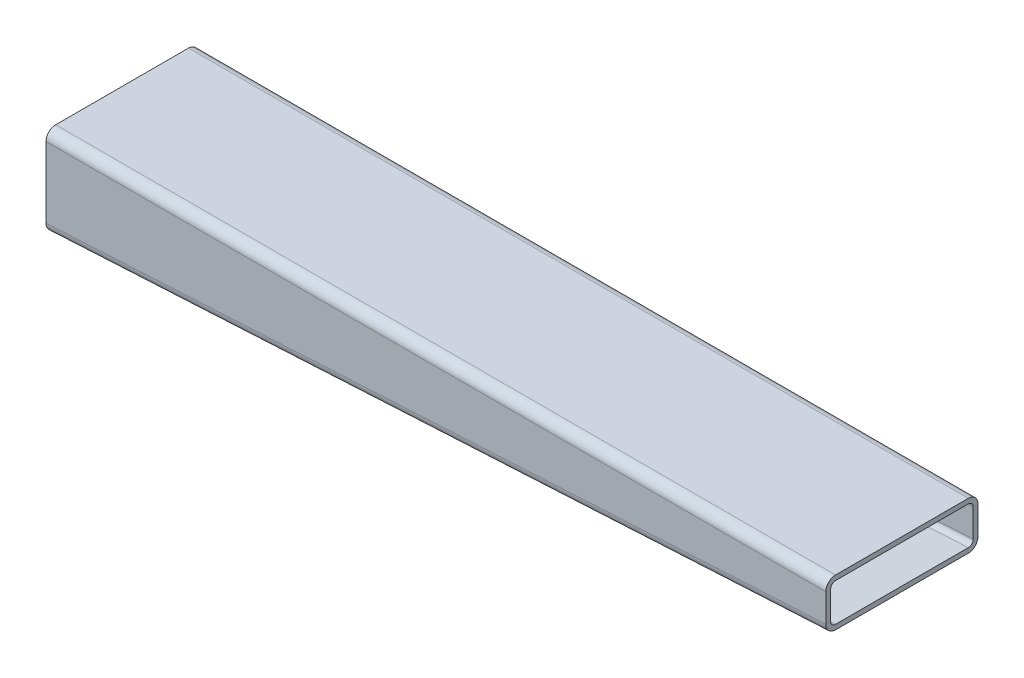
ISO-10303-21;
HEADER;
FILE_DESCRIPTION(('STEP AP214'),'2;1');
FILE_NAME('part.step','',(''),(''),'','','');
FILE_SCHEMA(('AUTOMOTIVE_DESIGN { 1 0 10303 214 1 1 1 1 }'));
ENDSEC;
DATA;
#1=APPLICATION_CONTEXT('core data for automotive mechanical design processes');
#2=APPLICATION_PROTOCOL_DEFINITION('international standard','automotive_design',2000,#1);
#3=PRODUCT_CONTEXT('',#1,'mechanical');
#4=PRODUCT('Part','Part','',(#3));
#5=PRODUCT_RELATED_PRODUCT_CATEGORY('part','',(#4));
#6=PRODUCT_DEFINITION_FORMATION('','',#4);
#7=PRODUCT_DEFINITION_CONTEXT('part definition',#1,'design');
#8=PRODUCT_DEFINITION('design','',#6,#7);
#9=PRODUCT_DEFINITION_SHAPE('','',#8);
#10=(LENGTH_UNIT() NAMED_UNIT(*) SI_UNIT(.MILLI.,.METRE.));
#11=(NAMED_UNIT(*) PLANE_ANGLE_UNIT() SI_UNIT($,.RADIAN.));
#12=(NAMED_UNIT(*) SI_UNIT($,.STERADIAN.) SOLID_ANGLE_UNIT());
#13=UNCERTAINTY_MEASURE_WITH_UNIT(LENGTH_MEASURE(1.E-05),#10,'distance_accuracy_value','');
#14=(GEOMETRIC_REPRESENTATION_CONTEXT(3) GLOBAL_UNCERTAINTY_ASSIGNED_CONTEXT((#13)) GLOBAL_UNIT_ASSIGNED_CONTEXT((#10,
#11,#12)) REPRESENTATION_CONTEXT('',''));
#15=CARTESIAN_POINT('',(0.,0.,0.));
#16=DIRECTION('',(0.,0.,1.));
#17=DIRECTION('',(1.,0.,0.));
#18=AXIS2_PLACEMENT_3D('',#15,#16,#17);
#19=CARTESIAN_POINT('',(-1.37334345273566,22.8332010753825,3.11187354387963));
#20=DIRECTION('',(0.998513539846474,0.0545042268385142,0.));
#21=DIRECTION('',(-0.0545042268385142,0.998513539846474,0.));
#22=AXIS2_PLACEMENT_3D('',#19,#20,#21);
#23=CYLINDRICAL_SURFACE('',#22,5.08);
#24=DIRECTION('',(-0.998513539846474,-0.0545042268385142,0.));
#25=VECTOR('',#24,1.);
#26=CARTESIAN_POINT('',(-1.37334345273566,22.8332010753825,-1.96812645612037));
#27=LINE('',#26,#25);
#28=CARTESIAN_POINT('',(406.324966402938,45.0875624588737,-1.96812645612037));
#29=VERTEX_POINT('',#28);
#30=CARTESIAN_POINT('',(-3.67503359706234,22.7075624768737,-1.96812645612037));
#31=VERTEX_POINT('',#30);
#32=EDGE_CURVE('E266',#29,#31,#27,.T.);
#33=ORIENTED_EDGE('',*,*,#32,.F.);
#34=CARTESIAN_POINT('',(406.324966402938,45.0875624588737,3.11187354387963));
#35=DIRECTION('',(-1.,0.,0.));
#36=DIRECTION('',(0.,1.,0.));
#37=AXIS2_PLACEMENT_3D('',#34,#35,#36);
#38=ELLIPSE('',#37,5.08756245887369,5.08);
#39=CARTESIAN_POINT('',(406.324966402938,40.,3.11187354387963));
#40=VERTEX_POINT('',#39);
#41=EDGE_CURVE('E40',#40,#29,#38,.F.);
#42=ORIENTED_EDGE('',*,*,#41,.F.);
#43=DIRECTION('',(-0.998513539846474,-0.0545042268385142,0.));
#44=VECTOR('',#43,1.);
#45=CARTESIAN_POINT('',(-1.09646198039601,17.7607522929624,3.11187354387963));
#46=LINE('',#45,#44);
#47=CARTESIAN_POINT('',(-3.67503359706233,17.620000018,3.11187354387963));
#48=VERTEX_POINT('',#47);
#49=EDGE_CURVE('E269',#48,#40,#46,.F.);
#50=ORIENTED_EDGE('',*,*,#49,.F.);
#51=CARTESIAN_POINT('',(-3.67503359706234,22.7075624768737,3.11187354387963));
#52=DIRECTION('',(1.,0.,0.));
#53=DIRECTION('',(0.,1.,0.));
#54=AXIS2_PLACEMENT_3D('',#51,#52,#53);
#55=ELLIPSE('',#54,5.08756245887369,5.08);
#56=EDGE_CURVE('E11',#31,#48,#55,.F.);
#57=ORIENTED_EDGE('',*,*,#56,.F.);
#58=EDGE_LOOP('',(#33,#42,#50,#57));
#59=FACE_BOUND('',#58,.T.);
#60=ADVANCED_FACE('F33',(#59),#23,.T.);
#61=CARTESIAN_POINT('',(0.,59.92,3.11187354387963));
#62=DIRECTION('',(1.,0.,0.));
#63=DIRECTION('',(0.,0.,-1.));
#64=AXIS2_PLACEMENT_3D('',#61,#62,#63);
#65=CYLINDRICAL_SURFACE('',#64,5.08);
#66=DIRECTION('',(-1.,0.,0.));
#67=VECTOR('',#66,1.);
#68=CARTESIAN_POINT('',(0.,65.,3.11187354387963));
#69=LINE('',#68,#67);
#70=CARTESIAN_POINT('',(406.324966402938,65.,3.11187354387963));
#71=VERTEX_POINT('',#70);
#72=CARTESIAN_POINT('',(-3.67503359706234,65.,3.11187354387963));
#73=VERTEX_POINT('',#72);
#74=EDGE_CURVE('E256',#71,#73,#69,.T.);
#75=ORIENTED_EDGE('',*,*,#74,.F.);
#76=CARTESIAN_POINT('',(406.324966402938,59.92,3.11187354387963));
#77=DIRECTION('',(-1.,0.,0.));
#78=DIRECTION('',(0.,0.,1.));
#79=AXIS2_PLACEMENT_3D('',#76,#77,#78);
#80=CIRCLE('',#79,5.08);
#81=CARTESIAN_POINT('',(406.324966402938,59.92,-1.96812645612037));
#82=VERTEX_POINT('',#81);
#83=EDGE_CURVE('E262',#82,#71,#80,.F.);
#84=ORIENTED_EDGE('',*,*,#83,.F.);
#85=DIRECTION('',(-1.,0.,0.));
#86=VECTOR('',#85,1.);
#87=CARTESIAN_POINT('',(0.,59.92,-1.96812645612037));
#88=LINE('',#87,#86);
#89=CARTESIAN_POINT('',(-3.67503359706234,59.92,-1.96812645612037));
#90=VERTEX_POINT('',#89);
#91=EDGE_CURVE('E259',#90,#82,#88,.F.);
#92=ORIENTED_EDGE('',*,*,#91,.F.);
#93=CARTESIAN_POINT('',(-3.67503359706234,59.92,3.11187354387963));
#94=DIRECTION('',(1.,0.,0.));
#95=DIRECTION('',(0.,0.,-1.));
#96=AXIS2_PLACEMENT_3D('',#93,#94,#95);
#97=CIRCLE('',#96,5.08);
#98=EDGE_CURVE('E264',#73,#90,#97,.F.);
#99=ORIENTED_EDGE('',*,*,#98,.F.);
#100=EDGE_LOOP('',(#75,#84,#92,#99));
#101=FACE_BOUND('',#100,.T.);
#102=ADVANCED_FACE('F283',(#101),#65,.T.);
#103=CARTESIAN_POINT('',(-1.37334345273565,22.8332010753825,72.9518735638796));
#104=DIRECTION('',(-0.998513539846474,-0.0545042268385142,0.));
#105=DIRECTION('',(0.0545042268385142,-0.998513539846474,0.));
#106=AXIS2_PLACEMENT_3D('',#103,#104,#105);
#107=CYLINDRICAL_SURFACE('',#106,5.08);
#108=DIRECTION('',(0.998513539846474,0.0545042268385142,0.));
#109=VECTOR('',#108,1.);
#110=CARTESIAN_POINT('',(-1.37334345273565,22.8332010753825,78.0318735638796));
#111=LINE('',#110,#109);
#112=CARTESIAN_POINT('',(-3.67503359706233,22.7075624768737,78.0318735638796));
#113=VERTEX_POINT('',#112);
#114=CARTESIAN_POINT('',(406.324966402938,45.0875624588737,78.0318735638796));
#115=VERTEX_POINT('',#114);
#116=EDGE_CURVE('E245',#113,#115,#111,.T.);
#117=ORIENTED_EDGE('',*,*,#116,.F.);
#118=CARTESIAN_POINT('',(-3.67503359706233,22.7075624768737,72.9518735638796));
#119=DIRECTION('',(1.,0.,0.));
#120=DIRECTION('',(0.,-1.,0.));
#121=AXIS2_PLACEMENT_3D('',#118,#119,#120);
#122=ELLIPSE('',#121,5.08756245887369,5.08);
#123=CARTESIAN_POINT('',(-3.67503359706233,17.620000018,72.9518735638796));
#124=VERTEX_POINT('',#123);
#125=EDGE_CURVE('E251',#124,#113,#122,.F.);
#126=ORIENTED_EDGE('',*,*,#125,.F.);
#127=DIRECTION('',(0.998513539846474,0.0545042268385142,0.));
#128=VECTOR('',#127,1.);
#129=CARTESIAN_POINT('',(-1.096461980396,17.7607522929624,72.9518735638796));
#130=LINE('',#129,#128);
#131=CARTESIAN_POINT('',(406.324966402938,40.,72.9518735638796));
#132=VERTEX_POINT('',#131);
#133=EDGE_CURVE('E248',#132,#124,#130,.F.);
#134=ORIENTED_EDGE('',*,*,#133,.F.);
#135=CARTESIAN_POINT('',(406.324966402938,45.0875624588737,72.9518735638796));
#136=DIRECTION('',(-1.,0.,0.));
#137=DIRECTION('',(0.,-1.,0.));
#138=AXIS2_PLACEMENT_3D('',#135,#136,#137);
#139=ELLIPSE('',#138,5.08756245887369,5.08);
#140=EDGE_CURVE('E253',#115,#132,#139,.F.);
#141=ORIENTED_EDGE('',*,*,#140,.F.);
#142=EDGE_LOOP('',(#117,#126,#134,#141));
#143=FACE_BOUND('',#142,.T.);
#144=ADVANCED_FACE('F300',(#143),#107,.T.);
#145=CARTESIAN_POINT('',(0.,59.92,72.9518735638796));
#146=DIRECTION('',(-1.,0.,0.));
#147=DIRECTION('',(0.,0.,1.));
#148=AXIS2_PLACEMENT_3D('',#145,#146,#147);
#149=CYLINDRICAL_SURFACE('',#148,5.08);
#150=DIRECTION('',(1.,0.,0.));
#151=VECTOR('',#150,1.);
#152=CARTESIAN_POINT('',(0.,65.,72.9518735638796));
#153=LINE('',#152,#151);
#154=CARTESIAN_POINT('',(-3.67503359706233,65.,72.9518735638796));
#155=VERTEX_POINT('',#154);
#156=CARTESIAN_POINT('',(406.324966402938,65.,72.9518735638796));
#157=VERTEX_POINT('',#156);
#158=EDGE_CURVE('E234',#155,#157,#153,.T.);
#159=ORIENTED_EDGE('',*,*,#158,.F.);
#160=CARTESIAN_POINT('',(-3.67503359706233,59.92,72.9518735638796));
#161=DIRECTION('',(1.,0.,0.));
#162=DIRECTION('',(0.,0.,-1.));
#163=AXIS2_PLACEMENT_3D('',#160,#161,#162);
#164=CIRCLE('',#163,5.08);
#165=CARTESIAN_POINT('',(-3.67503359706233,59.92,78.0318735638796));
#166=VERTEX_POINT('',#165);
#167=EDGE_CURVE('E240',#166,#155,#164,.F.);
#168=ORIENTED_EDGE('',*,*,#167,.F.);
#169=DIRECTION('',(1.,0.,0.));
#170=VECTOR('',#169,1.);
#171=CARTESIAN_POINT('',(0.,59.92,78.0318735638796));
#172=LINE('',#171,#170);
#173=CARTESIAN_POINT('',(406.324966402938,59.92,78.0318735638796));
#174=VERTEX_POINT('',#173);
#175=EDGE_CURVE('E237',#174,#166,#172,.F.);
#176=ORIENTED_EDGE('',*,*,#175,.F.);
#177=CARTESIAN_POINT('',(406.324966402938,59.92,72.9518735638796));
#178=DIRECTION('',(-1.,0.,0.));
#179=DIRECTION('',(0.,0.,1.));
#180=AXIS2_PLACEMENT_3D('',#177,#178,#179);
#181=CIRCLE('',#180,5.08);
#182=EDGE_CURVE('E243',#157,#174,#181,.F.);
#183=ORIENTED_EDGE('',*,*,#182,.F.);
#184=EDGE_LOOP('',(#159,#168,#176,#183));
#185=FACE_BOUND('',#184,.T.);
#186=ADVANCED_FACE('F291',(#185),#149,.T.);
#187=CARTESIAN_POINT('',(-3.67503359706234,65.,-1.96812645612037));
#188=DIRECTION('',(1.,0.,0.));
#189=DIRECTION('',(0.,0.,-1.));
#190=AXIS2_PLACEMENT_3D('',#187,#188,#189);
#191=PLANE('',#190);
#192=DIRECTION('',(0.,-1.,0.));
#193=VECTOR('',#192,1.);
#194=CARTESIAN_POINT('',(-3.67503359706234,65.,-1.96812645612037));
#195=LINE('',#194,#193);
#196=EDGE_CURVE('E223',#90,#31,#195,.T.);
#197=ORIENTED_EDGE('',*,*,#196,.T.);
#198=ORIENTED_EDGE('',*,*,#56,.T.);
#199=DIRECTION('',(0.,0.,1.));
#200=VECTOR('',#199,1.);
#201=CARTESIAN_POINT('',(-3.67503359706233,17.620000018,-18.4881264361204));
#202=LINE('',#201,#200);
#203=EDGE_CURVE('E154',#48,#124,#202,.T.);
#204=ORIENTED_EDGE('',*,*,#203,.T.);
#205=ORIENTED_EDGE('',*,*,#125,.T.);
#206=DIRECTION('',(0.,-1.,0.));
#207=VECTOR('',#206,1.);
#208=CARTESIAN_POINT('',(-3.67503359706233,65.,78.0318735638796));
#209=LINE('',#208,#207);
#210=EDGE_CURVE('E231',#166,#113,#209,.T.);
#211=ORIENTED_EDGE('',*,*,#210,.F.);
#212=ORIENTED_EDGE('',*,*,#167,.T.);
#213=DIRECTION('',(0.,0.,1.));
#214=VECTOR('',#213,1.);
#215=CARTESIAN_POINT('',(-3.67503359706234,65.,-1.96812645612037));
#216=LINE('',#215,#214);
#217=EDGE_CURVE('E217',#73,#155,#216,.T.);
#218=ORIENTED_EDGE('',*,*,#217,.F.);
#219=ORIENTED_EDGE('',*,*,#98,.T.);
#220=EDGE_LOOP('',(#197,#198,#204,#205,#211,#212,#218,#219));
#221=FACE_BOUND('',#220,.T.);
#222=ADVANCED_FACE('F304',(#221),#191,.F.);
#223=CARTESIAN_POINT('',(-3.67503359706233,65.,78.0318735638796));
#224=DIRECTION('',(0.,0.,-1.));
#225=DIRECTION('',(-1.,0.,0.));
#226=AXIS2_PLACEMENT_3D('',#223,#224,#225);
#227=PLANE('',#226);
#228=ORIENTED_EDGE('',*,*,#210,.T.);
#229=ORIENTED_EDGE('',*,*,#116,.T.);
#230=DIRECTION('',(0.,-1.,0.));
#231=VECTOR('',#230,1.);
#232=CARTESIAN_POINT('',(406.324966402938,65.,78.0318735638796));
#233=LINE('',#232,#231);
#234=EDGE_CURVE('E228',#174,#115,#233,.T.);
#235=ORIENTED_EDGE('',*,*,#234,.F.);
#236=ORIENTED_EDGE('',*,*,#175,.T.);
#237=EDGE_LOOP('',(#228,#229,#235,#236));
#238=FACE_BOUND('',#237,.T.);
#239=ADVANCED_FACE('F295',(#238),#227,.F.);
#240=CARTESIAN_POINT('',(406.324966402938,65.,-1.96812645612037));
#241=DIRECTION('',(-1.,0.,0.));
#242=DIRECTION('',(0.,0.,1.));
#243=AXIS2_PLACEMENT_3D('',#240,#241,#242);
#244=PLANE('',#243);
#245=CARTESIAN_POINT('',(406.324966402938,45.0875624588737,3.11187354387963));
#246=DIRECTION('',(-1.,0.,0.));
#247=DIRECTION('',(0.,1.,0.));
#248=AXIS2_PLACEMENT_3D('',#245,#246,#247);
#249=ELLIPSE('',#248,2.54378122943685,2.54);
#250=CARTESIAN_POINT('',(406.324966402938,42.5437812294368,3.11187354387964));
#251=VERTEX_POINT('',#250);
#252=CARTESIAN_POINT('',(406.324966402938,45.0875624588737,0.571873543879633));
#253=VERTEX_POINT('',#252);
#254=EDGE_CURVE('E155',#251,#253,#249,.F.);
#255=ORIENTED_EDGE('',*,*,#254,.F.);
#256=DIRECTION('',(0.,0.,1.));
#257=VECTOR('',#256,1.);
#258=CARTESIAN_POINT('',(406.324966402938,42.5437812294368,-1.96812645612037));
#259=LINE('',#258,#257);
#260=CARTESIAN_POINT('',(406.324966402938,42.5437812294368,72.9518735638797));
#261=VERTEX_POINT('',#260);
#262=EDGE_CURVE('E180',#251,#261,#259,.T.);
#263=ORIENTED_EDGE('',*,*,#262,.T.);
#264=CARTESIAN_POINT('',(406.324966402938,45.0875624588737,72.9518735638796));
#265=DIRECTION('',(-1.,0.,0.));
#266=DIRECTION('',(0.,-1.,0.));
#267=AXIS2_PLACEMENT_3D('',#264,#265,#266);
#268=ELLIPSE('',#267,2.54378122943685,2.54);
#269=CARTESIAN_POINT('',(406.324966402938,45.0875624588737,75.4918735638796));
#270=VERTEX_POINT('',#269);
#271=EDGE_CURVE('E183',#270,#261,#268,.F.);
#272=ORIENTED_EDGE('',*,*,#271,.F.);
#273=DIRECTION('',(0.,-1.,0.));
#274=VECTOR('',#273,1.);
#275=CARTESIAN_POINT('',(406.324966402938,65.,75.4918735638796));
#276=LINE('',#275,#274);
#277=CARTESIAN_POINT('',(406.324966402938,59.92,75.4918735638796));
#278=VERTEX_POINT('',#277);
#279=EDGE_CURVE('E47',#278,#270,#276,.T.);
#280=ORIENTED_EDGE('',*,*,#279,.F.);
#281=CARTESIAN_POINT('',(406.324966402938,59.92,72.9518735638796));
#282=DIRECTION('',(-1.,0.,0.));
#283=DIRECTION('',(0.,0.,1.));
#284=AXIS2_PLACEMENT_3D('',#281,#282,#283);
#285=CIRCLE('',#284,2.54);
#286=CARTESIAN_POINT('',(406.324966402938,62.46,72.9518735638796));
#287=VERTEX_POINT('',#286);
#288=EDGE_CURVE('E192',#287,#278,#285,.F.);
#289=ORIENTED_EDGE('',*,*,#288,.F.);
#290=DIRECTION('',(0.,0.,-1.));
#291=VECTOR('',#290,1.);
#292=CARTESIAN_POINT('',(406.324966402938,62.46,-1.96812645612037));
#293=LINE('',#292,#291);
#294=CARTESIAN_POINT('',(406.324966402938,62.46,3.11187354387963));
#295=VERTEX_POINT('',#294);
#296=EDGE_CURVE('E171',#287,#295,#293,.T.);
#297=ORIENTED_EDGE('',*,*,#296,.T.);
#298=CARTESIAN_POINT('',(406.324966402938,59.92,3.11187354387963));
#299=DIRECTION('',(-1.,0.,0.));
#300=DIRECTION('',(0.,0.,1.));
#301=AXIS2_PLACEMENT_3D('',#298,#299,#300);
#302=CIRCLE('',#301,2.54);
#303=CARTESIAN_POINT('',(406.324966402938,59.92,0.571873543879633));
#304=VERTEX_POINT('',#303);
#305=EDGE_CURVE('E196',#304,#295,#302,.F.);
#306=ORIENTED_EDGE('',*,*,#305,.F.);
#307=DIRECTION('',(0.,-1.,0.));
#308=VECTOR('',#307,1.);
#309=CARTESIAN_POINT('',(406.324966402938,65.,0.571873543879633));
#310=LINE('',#309,#308);
#311=EDGE_CURVE('E170',#304,#253,#310,.T.);
#312=ORIENTED_EDGE('',*,*,#311,.T.);
#313=EDGE_LOOP('',(#255,#263,#272,#280,#289,#297,#306,#312));
#314=FACE_BOUND('',#313,.T.);
#315=DIRECTION('',(0.,0.,1.));
#316=VECTOR('',#315,1.);
#317=CARTESIAN_POINT('',(406.324966402938,40.,-18.4881264361204));
#318=LINE('',#317,#316);
#319=EDGE_CURVE('E215',#40,#132,#318,.T.);
#320=ORIENTED_EDGE('',*,*,#319,.F.);
#321=ORIENTED_EDGE('',*,*,#41,.T.);
#322=DIRECTION('',(0.,-1.,0.));
#323=VECTOR('',#322,1.);
#324=CARTESIAN_POINT('',(406.324966402938,65.,-1.96812645612037));
#325=LINE('',#324,#323);
#326=EDGE_CURVE('E225',#82,#29,#325,.T.);
#327=ORIENTED_EDGE('',*,*,#326,.F.);
#328=ORIENTED_EDGE('',*,*,#83,.T.);
#329=DIRECTION('',(0.,0.,-1.));
#330=VECTOR('',#329,1.);
#331=CARTESIAN_POINT('',(406.324966402938,65.,-1.96812645612037));
#332=LINE('',#331,#330);
#333=EDGE_CURVE('E220',#157,#71,#332,.T.);
#334=ORIENTED_EDGE('',*,*,#333,.F.);
#335=ORIENTED_EDGE('',*,*,#182,.T.);
#336=ORIENTED_EDGE('',*,*,#234,.T.);
#337=ORIENTED_EDGE('',*,*,#140,.T.);
#338=EDGE_LOOP('',(#320,#321,#327,#328,#334,#335,#336,#337));
#339=FACE_BOUND('',#338,.T.);
#340=ADVANCED_FACE('F275',(#314,#339),#244,.F.);
#341=CARTESIAN_POINT('',(-3.67503359706234,65.,-1.96812645612037));
#342=DIRECTION('',(0.,0.,1.));
#343=DIRECTION('',(1.,0.,0.));
#344=AXIS2_PLACEMENT_3D('',#341,#342,#343);
#345=PLANE('',#344);
#346=ORIENTED_EDGE('',*,*,#326,.T.);
#347=ORIENTED_EDGE('',*,*,#32,.T.);
#348=ORIENTED_EDGE('',*,*,#196,.F.);
#349=ORIENTED_EDGE('',*,*,#91,.T.);
#350=EDGE_LOOP('',(#346,#347,#348,#349));
#351=FACE_BOUND('',#350,.T.);
#352=ADVANCED_FACE('F279',(#351),#345,.F.);
#353=CARTESIAN_POINT('',(0.,65.,0.));
#354=DIRECTION('',(0.,1.,0.));
#355=DIRECTION('',(0.,0.,1.));
#356=AXIS2_PLACEMENT_3D('',#353,#354,#355);
#357=PLANE('',#356);
#358=ORIENTED_EDGE('',*,*,#333,.T.);
#359=ORIENTED_EDGE('',*,*,#74,.T.);
#360=ORIENTED_EDGE('',*,*,#217,.T.);
#361=ORIENTED_EDGE('',*,*,#158,.T.);
#362=EDGE_LOOP('',(#358,#359,#360,#361));
#363=FACE_BOUND('',#362,.T.);
#364=ADVANCED_FACE('F287',(#363),#357,.T.);
#365=CARTESIAN_POINT('',(-0.969854396135123,17.7676632142636,-18.4881264361204));
#366=DIRECTION('',(0.0545042268385142,-0.998513539846474,0.));
#367=DIRECTION('',(0.998513539846474,0.0545042268385142,0.));
#368=AXIS2_PLACEMENT_3D('',#365,#366,#367);
#369=PLANE('',#368);
#370=ORIENTED_EDGE('',*,*,#203,.F.);
#371=ORIENTED_EDGE('',*,*,#49,.T.);
#372=ORIENTED_EDGE('',*,*,#319,.T.);
#373=ORIENTED_EDGE('',*,*,#133,.T.);
#374=EDGE_LOOP('',(#370,#371,#372,#373));
#375=FACE_BOUND('',#374,.T.);
#376=ADVANCED_FACE('F303',(#375),#369,.T.);
#377=CARTESIAN_POINT('',(-1.37334345273566,22.8332010753825,3.11187354387963));
#378=DIRECTION('',(0.998513539846474,0.0545042268385142,0.));
#379=DIRECTION('',(-0.0545042268385142,0.998513539846474,0.));
#380=AXIS2_PLACEMENT_3D('',#377,#378,#379);
#381=CYLINDRICAL_SURFACE('',#380,2.54);
#382=DIRECTION('',(0.998513539846474,0.0545042268385142,0.));
#383=VECTOR('',#382,1.);
#384=CARTESIAN_POINT('',(-1.37334345273566,22.8332010753825,0.571873543879633));
#385=LINE('',#384,#383);
#386=CARTESIAN_POINT('',(-1.13503359706234,22.8462093060305,0.571873543879633));
#387=VERTEX_POINT('',#386);
#388=EDGE_CURVE('E158',#253,#387,#385,.F.);
#389=ORIENTED_EDGE('',*,*,#388,.T.);
#390=CARTESIAN_POINT('',(-1.13503359706234,22.8462093060305,3.11187354387963));
#391=DIRECTION('',(1.,0.,0.));
#392=DIRECTION('',(0.,1.,0.));
#393=AXIS2_PLACEMENT_3D('',#390,#391,#392);
#394=ELLIPSE('',#393,2.54378122943685,2.54);
#395=CARTESIAN_POINT('',(-1.13503359706234,20.3024280765936,3.11187354387964));
#396=VERTEX_POINT('',#395);
#397=EDGE_CURVE('E145',#387,#396,#394,.F.);
#398=ORIENTED_EDGE('',*,*,#397,.T.);
#399=DIRECTION('',(0.998513539846474,0.0545042268385142,0.));
#400=VECTOR('',#399,1.);
#401=CARTESIAN_POINT('',(-1.10829513230495,20.3038876054736,3.11187354387964));
#402=LINE('',#401,#400);
#403=EDGE_CURVE('E164',#396,#251,#402,.T.);
#404=ORIENTED_EDGE('',*,*,#403,.T.);
#405=ORIENTED_EDGE('',*,*,#254,.T.);
#406=EDGE_LOOP('',(#389,#398,#404,#405));
#407=FACE_BOUND('',#406,.T.);
#408=ADVANCED_FACE('F159',(#407),#381,.F.);
#409=CARTESIAN_POINT('',(0.,59.92,3.11187354387963));
#410=DIRECTION('',(1.,0.,0.));
#411=DIRECTION('',(0.,0.,-1.));
#412=AXIS2_PLACEMENT_3D('',#409,#410,#411);
#413=CYLINDRICAL_SURFACE('',#412,2.54);
#414=DIRECTION('',(1.,0.,0.));
#415=VECTOR('',#414,1.);
#416=CARTESIAN_POINT('',(0.,62.46,3.11187354387963));
#417=LINE('',#416,#415);
#418=CARTESIAN_POINT('',(-1.13503359706234,62.46,3.11187354387963));
#419=VERTEX_POINT('',#418);
#420=EDGE_CURVE('E197',#295,#419,#417,.F.);
#421=ORIENTED_EDGE('',*,*,#420,.T.);
#422=CARTESIAN_POINT('',(-1.13503359706234,59.92,3.11187354387963));
#423=DIRECTION('',(1.,0.,0.));
#424=DIRECTION('',(0.,0.,-1.));
#425=AXIS2_PLACEMENT_3D('',#422,#423,#424);
#426=CIRCLE('',#425,2.54);
#427=CARTESIAN_POINT('',(-1.13503359706234,59.92,0.571873543879633));
#428=VERTEX_POINT('',#427);
#429=EDGE_CURVE('E165',#419,#428,#426,.F.);
#430=ORIENTED_EDGE('',*,*,#429,.T.);
#431=DIRECTION('',(1.,0.,0.));
#432=VECTOR('',#431,1.);
#433=CARTESIAN_POINT('',(-3.67503359706234,59.92,0.571873543879633));
#434=LINE('',#433,#432);
#435=EDGE_CURVE('E169',#428,#304,#434,.T.);
#436=ORIENTED_EDGE('',*,*,#435,.T.);
#437=ORIENTED_EDGE('',*,*,#305,.T.);
#438=EDGE_LOOP('',(#421,#430,#436,#437));
#439=FACE_BOUND('',#438,.T.);
#440=ADVANCED_FACE('F354',(#439),#413,.F.);
#441=CARTESIAN_POINT('',(-1.37334345273565,22.8332010753825,72.9518735638796));
#442=DIRECTION('',(-0.998513539846474,-0.0545042268385142,0.));
#443=DIRECTION('',(0.0545042268385142,-0.998513539846474,0.));
#444=AXIS2_PLACEMENT_3D('',#441,#442,#443);
#445=CYLINDRICAL_SURFACE('',#444,2.54);
#446=DIRECTION('',(-0.998513539846474,-0.0545042268385142,0.));
#447=VECTOR('',#446,1.);
#448=CARTESIAN_POINT('',(-1.37334345273565,22.8332010753825,75.4918735638796));
#449=LINE('',#448,#447);
#450=CARTESIAN_POINT('',(-1.13503359706233,22.8462093060305,75.4918735638796));
#451=VERTEX_POINT('',#450);
#452=EDGE_CURVE('E204',#451,#270,#449,.F.);
#453=ORIENTED_EDGE('',*,*,#452,.T.);
#454=ORIENTED_EDGE('',*,*,#271,.T.);
#455=DIRECTION('',(0.998513539846474,0.0545042268385142,0.));
#456=VECTOR('',#455,1.);
#457=CARTESIAN_POINT('',(-1.10829513230495,20.3038876054736,72.9518735638797));
#458=LINE('',#457,#456);
#459=CARTESIAN_POINT('',(-1.13503359706233,20.3024280765936,72.9518735638797));
#460=VERTEX_POINT('',#459);
#461=EDGE_CURVE('E184',#261,#460,#458,.F.);
#462=ORIENTED_EDGE('',*,*,#461,.T.);
#463=CARTESIAN_POINT('',(-1.13503359706233,22.8462093060305,72.9518735638796));
#464=DIRECTION('',(1.,0.,0.));
#465=DIRECTION('',(0.,-1.,0.));
#466=AXIS2_PLACEMENT_3D('',#463,#464,#465);
#467=ELLIPSE('',#466,2.54378122943685,2.54);
#468=EDGE_CURVE('E181',#460,#451,#467,.F.);
#469=ORIENTED_EDGE('',*,*,#468,.T.);
#470=EDGE_LOOP('',(#453,#454,#462,#469));
#471=FACE_BOUND('',#470,.T.);
#472=ADVANCED_FACE('F363',(#471),#445,.F.);
#473=CARTESIAN_POINT('',(0.,59.92,72.9518735638796));
#474=DIRECTION('',(-1.,0.,0.));
#475=DIRECTION('',(0.,0.,1.));
#476=AXIS2_PLACEMENT_3D('',#473,#474,#475);
#477=CYLINDRICAL_SURFACE('',#476,2.54);
#478=DIRECTION('',(1.,0.,0.));
#479=VECTOR('',#478,1.);
#480=CARTESIAN_POINT('',(0.,62.46,72.9518735638796));
#481=LINE('',#480,#479);
#482=CARTESIAN_POINT('',(-1.13503359706233,62.46,72.9518735638796));
#483=VERTEX_POINT('',#482);
#484=EDGE_CURVE('E188',#483,#287,#481,.T.);
#485=ORIENTED_EDGE('',*,*,#484,.T.);
#486=ORIENTED_EDGE('',*,*,#288,.T.);
#487=DIRECTION('',(-1.,0.,0.));
#488=VECTOR('',#487,1.);
#489=CARTESIAN_POINT('',(-3.67503359706233,59.92,75.4918735638796));
#490=LINE('',#489,#488);
#491=CARTESIAN_POINT('',(-1.13503359706233,59.92,75.4918735638796));
#492=VERTEX_POINT('',#491);
#493=EDGE_CURVE('E193',#278,#492,#490,.T.);
#494=ORIENTED_EDGE('',*,*,#493,.T.);
#495=CARTESIAN_POINT('',(-1.13503359706233,59.92,72.9518735638796));
#496=DIRECTION('',(1.,0.,0.));
#497=DIRECTION('',(0.,0.,-1.));
#498=AXIS2_PLACEMENT_3D('',#495,#496,#497);
#499=CIRCLE('',#498,2.54);
#500=EDGE_CURVE('E189',#492,#483,#499,.F.);
#501=ORIENTED_EDGE('',*,*,#500,.T.);
#502=EDGE_LOOP('',(#485,#486,#494,#501));
#503=FACE_BOUND('',#502,.T.);
#504=ADVANCED_FACE('F372',(#503),#477,.F.);
#505=CARTESIAN_POINT('',(-1.13503359706234,65.,-1.96812645612037));
#506=DIRECTION('',(1.,0.,0.));
#507=DIRECTION('',(0.,0.,-1.));
#508=AXIS2_PLACEMENT_3D('',#505,#506,#507);
#509=PLANE('',#508);
#510=DIRECTION('',(0.,-1.,0.));
#511=VECTOR('',#510,1.);
#512=CARTESIAN_POINT('',(-1.13503359706234,65.,0.571873543879633));
#513=LINE('',#512,#511);
#514=EDGE_CURVE('E149',#428,#387,#513,.T.);
#515=ORIENTED_EDGE('',*,*,#514,.F.);
#516=ORIENTED_EDGE('',*,*,#429,.F.);
#517=DIRECTION('',(0.,0.,1.));
#518=VECTOR('',#517,1.);
#519=CARTESIAN_POINT('',(-1.13503359706234,62.46,-1.96812645612037));
#520=LINE('',#519,#518);
#521=EDGE_CURVE('E175',#419,#483,#520,.T.);
#522=ORIENTED_EDGE('',*,*,#521,.T.);
#523=ORIENTED_EDGE('',*,*,#500,.F.);
#524=DIRECTION('',(0.,-1.,0.));
#525=VECTOR('',#524,1.);
#526=CARTESIAN_POINT('',(-1.13503359706233,65.,75.4918735638796));
#527=LINE('',#526,#525);
#528=EDGE_CURVE('E185',#492,#451,#527,.T.);
#529=ORIENTED_EDGE('',*,*,#528,.T.);
#530=ORIENTED_EDGE('',*,*,#468,.F.);
#531=DIRECTION('',(0.,0.,1.));
#532=VECTOR('',#531,1.);
#533=CARTESIAN_POINT('',(-1.13503359706234,20.3024280765936,-18.4881264361204));
#534=LINE('',#533,#532);
#535=EDGE_CURVE('E151',#396,#460,#534,.T.);
#536=ORIENTED_EDGE('',*,*,#535,.F.);
#537=ORIENTED_EDGE('',*,*,#397,.F.);
#538=EDGE_LOOP('',(#515,#516,#522,#523,#529,#530,#536,#537));
#539=FACE_BOUND('',#538,.T.);
#540=ADVANCED_FACE('F147',(#539),#509,.T.);
#541=CARTESIAN_POINT('',(-3.67503359706233,65.,75.4918735638796));
#542=DIRECTION('',(0.,0.,-1.));
#543=DIRECTION('',(-1.,0.,0.));
#544=AXIS2_PLACEMENT_3D('',#541,#542,#543);
#545=PLANE('',#544);
#546=ORIENTED_EDGE('',*,*,#528,.F.);
#547=ORIENTED_EDGE('',*,*,#493,.F.);
#548=ORIENTED_EDGE('',*,*,#279,.T.);
#549=ORIENTED_EDGE('',*,*,#452,.F.);
#550=EDGE_LOOP('',(#546,#547,#548,#549));
#551=FACE_BOUND('',#550,.T.);
#552=ADVANCED_FACE('F389',(#551),#545,.T.);
#553=CARTESIAN_POINT('',(-3.67503359706234,65.,0.571873543879633));
#554=DIRECTION('',(0.,0.,1.));
#555=DIRECTION('',(1.,0.,0.));
#556=AXIS2_PLACEMENT_3D('',#553,#554,#555);
#557=PLANE('',#556);
#558=ORIENTED_EDGE('',*,*,#311,.F.);
#559=ORIENTED_EDGE('',*,*,#435,.F.);
#560=ORIENTED_EDGE('',*,*,#514,.T.);
#561=ORIENTED_EDGE('',*,*,#388,.F.);
#562=EDGE_LOOP('',(#558,#559,#560,#561));
#563=FACE_BOUND('',#562,.T.);
#564=ADVANCED_FACE('F168',(#563),#557,.T.);
#565=CARTESIAN_POINT('',(0.,62.46,0.));
#566=DIRECTION('',(0.,1.,0.));
#567=DIRECTION('',(0.,0.,1.));
#568=AXIS2_PLACEMENT_3D('',#565,#566,#567);
#569=PLANE('',#568);
#570=ORIENTED_EDGE('',*,*,#296,.F.);
#571=ORIENTED_EDGE('',*,*,#484,.F.);
#572=ORIENTED_EDGE('',*,*,#521,.F.);
#573=ORIENTED_EDGE('',*,*,#420,.F.);
#574=EDGE_LOOP('',(#570,#571,#572,#573));
#575=FACE_BOUND('',#574,.T.);
#576=ADVANCED_FACE('F404',(#575),#569,.F.);
#577=CARTESIAN_POINT('',(-1.10829513230495,20.3038876054736,-18.4881264361204));
#578=DIRECTION('',(0.0545042268385142,-0.998513539846474,0.));
#579=DIRECTION('',(0.998513539846474,0.0545042268385142,0.));
#580=AXIS2_PLACEMENT_3D('',#577,#578,#579);
#581=PLANE('',#580);
#582=ORIENTED_EDGE('',*,*,#535,.T.);
#583=ORIENTED_EDGE('',*,*,#461,.F.);
#584=ORIENTED_EDGE('',*,*,#262,.F.);
#585=ORIENTED_EDGE('',*,*,#403,.F.);
#586=EDGE_LOOP('',(#582,#583,#584,#585));
#587=FACE_BOUND('',#586,.T.);
#588=ADVANCED_FACE('F412',(#587),#581,.F.);
#589=CLOSED_SHELL('',(#60,#102,#144,#186,#222,#239,#340,#352,#364,#376,#408,#440,#472,#504,#540,
#552,#564,#576,#588));
#590=MANIFOLD_SOLID_BREP('B2',#589);
#591=ADVANCED_BREP_SHAPE_REPRESENTATION('',(#18,#590),#14);
#592=SHAPE_DEFINITION_REPRESENTATION(#9,#591);
ENDSEC;
END-ISO-10303-21;
